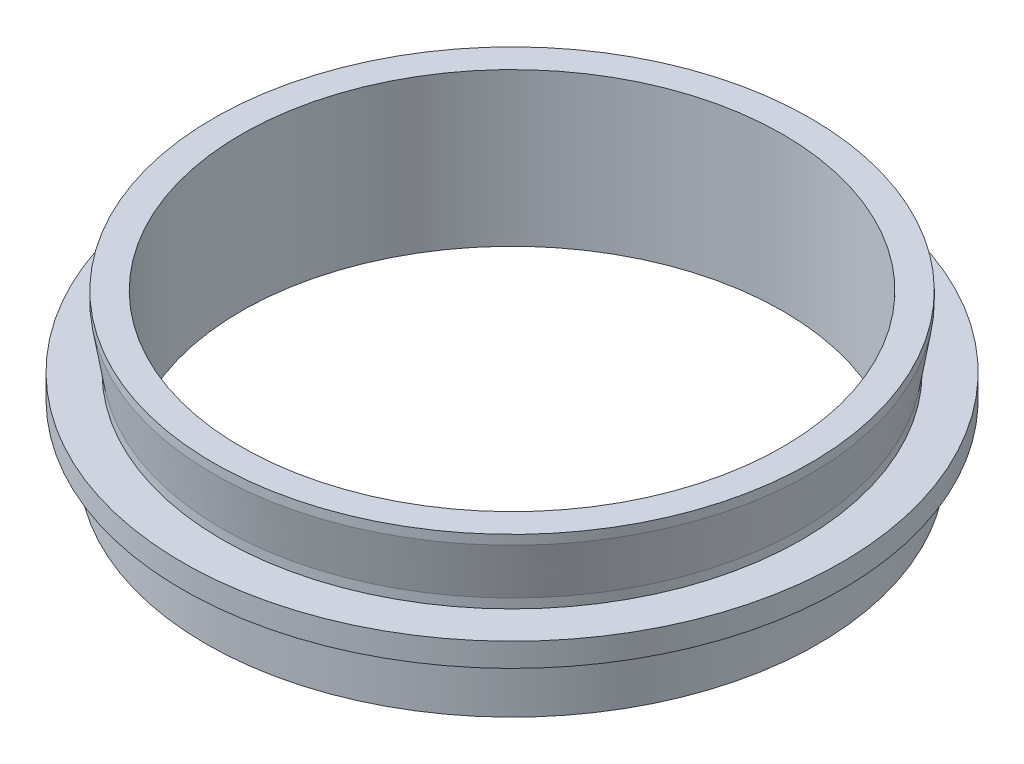
ISO-10303-21;
HEADER;
FILE_DESCRIPTION(('STEP AP214'),'2;1');
FILE_NAME('part.step','',(''),(''),'','','');
FILE_SCHEMA(('AUTOMOTIVE_DESIGN { 1 0 10303 214 1 1 1 1 }'));
ENDSEC;
DATA;
#1=APPLICATION_CONTEXT('core data for automotive mechanical design processes');
#2=APPLICATION_PROTOCOL_DEFINITION('international standard','automotive_design',2000,#1);
#3=PRODUCT_CONTEXT('',#1,'mechanical');
#4=PRODUCT('Part','Part','',(#3));
#5=PRODUCT_RELATED_PRODUCT_CATEGORY('part','',(#4));
#6=PRODUCT_DEFINITION_FORMATION('','',#4);
#7=PRODUCT_DEFINITION_CONTEXT('part definition',#1,'design');
#8=PRODUCT_DEFINITION('design','',#6,#7);
#9=PRODUCT_DEFINITION_SHAPE('','',#8);
#10=(LENGTH_UNIT() NAMED_UNIT(*) SI_UNIT(.MILLI.,.METRE.));
#11=(NAMED_UNIT(*) PLANE_ANGLE_UNIT() SI_UNIT($,.RADIAN.));
#12=(NAMED_UNIT(*) SI_UNIT($,.STERADIAN.) SOLID_ANGLE_UNIT());
#13=UNCERTAINTY_MEASURE_WITH_UNIT(LENGTH_MEASURE(1.E-05),#10,'distance_accuracy_value','');
#14=(GEOMETRIC_REPRESENTATION_CONTEXT(3) GLOBAL_UNCERTAINTY_ASSIGNED_CONTEXT((#13)) GLOBAL_UNIT_ASSIGNED_CONTEXT((#10,
#11,#12)) REPRESENTATION_CONTEXT('',''));
#15=CARTESIAN_POINT('',(0.,0.,0.));
#16=DIRECTION('',(0.,0.,1.));
#17=DIRECTION('',(1.,0.,0.));
#18=AXIS2_PLACEMENT_3D('',#15,#16,#17);
#19=CARTESIAN_POINT('',(-26.,0.,0.));
#20=DIRECTION('',(0.,1.,0.));
#21=DIRECTION('',(0.,0.,1.));
#22=AXIS2_PLACEMENT_3D('',#19,#20,#21);
#23=PLANE('',#22);
#24=CARTESIAN_POINT('',(0.,0.,0.));
#25=DIRECTION('',(0.,-1.,0.));
#26=DIRECTION('',(0.,0.,-1.));
#27=AXIS2_PLACEMENT_3D('',#24,#25,#26);
#28=CIRCLE('',#27,23.);
#29=CARTESIAN_POINT('',(0.,0.,-23.));
#30=VERTEX_POINT('',#29);
#31=EDGE_CURVE('E10',#30,#30,#28,.T.);
#32=ORIENTED_EDGE('',*,*,#31,.F.);
#33=EDGE_LOOP('',(#32));
#34=FACE_BOUND('',#33,.T.);
#35=CARTESIAN_POINT('',(0.,0.,0.));
#36=DIRECTION('',(0.,-1.,0.));
#37=DIRECTION('',(0.,0.,-1.));
#38=AXIS2_PLACEMENT_3D('',#35,#36,#37);
#39=CIRCLE('',#38,26.);
#40=CARTESIAN_POINT('',(0.,0.,-26.));
#41=VERTEX_POINT('',#40);
#42=EDGE_CURVE('E81',#41,#41,#39,.T.);
#43=ORIENTED_EDGE('',*,*,#42,.T.);
#44=EDGE_LOOP('',(#43));
#45=FACE_BOUND('',#44,.T.);
#46=ADVANCED_FACE('F41',(#34,#45),#23,.F.);
#47=CARTESIAN_POINT('',(0.,0.,0.));
#48=DIRECTION('',(0.,-1.,0.));
#49=DIRECTION('',(0.,0.,-1.));
#50=AXIS2_PLACEMENT_3D('',#47,#48,#49);
#51=CYLINDRICAL_SURFACE('',#50,23.);
#52=CARTESIAN_POINT('',(0.,13.,0.));
#53=DIRECTION('',(0.,-1.,0.));
#54=DIRECTION('',(0.,0.,-1.));
#55=AXIS2_PLACEMENT_3D('',#52,#53,#54);
#56=CIRCLE('',#55,23.);
#57=CARTESIAN_POINT('',(0.,13.,-23.));
#58=VERTEX_POINT('',#57);
#59=EDGE_CURVE('E47',#58,#58,#56,.T.);
#60=ORIENTED_EDGE('',*,*,#59,.F.);
#61=EDGE_LOOP('',(#60));
#62=FACE_BOUND('',#61,.T.);
#63=ORIENTED_EDGE('',*,*,#31,.T.);
#64=EDGE_LOOP('',(#63));
#65=FACE_BOUND('',#64,.T.);
#66=ADVANCED_FACE('F142',(#62,#65),#51,.F.);
#67=CARTESIAN_POINT('',(-23.,13.,0.));
#68=DIRECTION('',(0.,-1.,0.));
#69=DIRECTION('',(0.,0.,-1.));
#70=AXIS2_PLACEMENT_3D('',#67,#68,#69);
#71=PLANE('',#70);
#72=CARTESIAN_POINT('',(0.,13.,0.));
#73=DIRECTION('',(0.,-1.,0.));
#74=DIRECTION('',(0.,0.,-1.));
#75=AXIS2_PLACEMENT_3D('',#72,#73,#74);
#76=CIRCLE('',#75,25.365);
#77=CARTESIAN_POINT('',(0.,13.,-25.365));
#78=VERTEX_POINT('',#77);
#79=EDGE_CURVE('E51',#78,#78,#76,.T.);
#80=ORIENTED_EDGE('',*,*,#79,.F.);
#81=EDGE_LOOP('',(#80));
#82=FACE_BOUND('',#81,.T.);
#83=ORIENTED_EDGE('',*,*,#59,.T.);
#84=EDGE_LOOP('',(#83));
#85=FACE_BOUND('',#84,.T.);
#86=ADVANCED_FACE('F137',(#82,#85),#71,.F.);
#87=CARTESIAN_POINT('',(0.,0.,0.));
#88=DIRECTION('',(0.,-1.,0.));
#89=DIRECTION('',(0.,0.,-1.));
#90=AXIS2_PLACEMENT_3D('',#87,#88,#89);
#91=CYLINDRICAL_SURFACE('',#90,25.365);
#92=CARTESIAN_POINT('',(0.,12.2,0.));
#93=DIRECTION('',(0.,-1.,0.));
#94=DIRECTION('',(0.,0.,-1.));
#95=AXIS2_PLACEMENT_3D('',#92,#93,#94);
#96=CIRCLE('',#95,25.365);
#97=CARTESIAN_POINT('',(0.,12.2,-25.365));
#98=VERTEX_POINT('',#97);
#99=EDGE_CURVE('E55',#98,#98,#96,.T.);
#100=ORIENTED_EDGE('',*,*,#99,.F.);
#101=EDGE_LOOP('',(#100));
#102=FACE_BOUND('',#101,.T.);
#103=ORIENTED_EDGE('',*,*,#79,.T.);
#104=EDGE_LOOP('',(#103));
#105=FACE_BOUND('',#104,.T.);
#106=ADVANCED_FACE('F131',(#102,#105),#91,.T.);
#107=CARTESIAN_POINT('',(0.,12.2,0.));
#108=DIRECTION('',(0.,1.,0.));
#109=DIRECTION('',(0.,0.,1.));
#110=AXIS2_PLACEMENT_3D('',#107,#108,#109);
#111=CONICAL_SURFACE('',#110,25.365,0.164411486247026);
#112=CARTESIAN_POINT('',(0.,7.80000000000001,0.));
#113=DIRECTION('',(0.,-1.,0.));
#114=DIRECTION('',(0.,0.,-1.));
#115=AXIS2_PLACEMENT_3D('',#112,#113,#114);
#116=CIRCLE('',#115,24.635);
#117=CARTESIAN_POINT('',(0.,7.80000000000001,-24.635));
#118=VERTEX_POINT('',#117);
#119=EDGE_CURVE('E60',#118,#118,#116,.T.);
#120=ORIENTED_EDGE('',*,*,#119,.F.);
#121=EDGE_LOOP('',(#120));
#122=FACE_BOUND('',#121,.T.);
#123=ORIENTED_EDGE('',*,*,#99,.T.);
#124=EDGE_LOOP('',(#123));
#125=FACE_BOUND('',#124,.T.);
#126=ADVANCED_FACE('F125',(#122,#125),#111,.T.);
#127=CARTESIAN_POINT('',(0.,0.,0.));
#128=DIRECTION('',(0.,-1.,0.));
#129=DIRECTION('',(0.,0.,-1.));
#130=AXIS2_PLACEMENT_3D('',#127,#128,#129);
#131=CYLINDRICAL_SURFACE('',#130,24.635);
#132=CARTESIAN_POINT('',(0.,7.,0.));
#133=DIRECTION('',(0.,-1.,0.));
#134=DIRECTION('',(0.,0.,-1.));
#135=AXIS2_PLACEMENT_3D('',#132,#133,#134);
#136=CIRCLE('',#135,24.635);
#137=CARTESIAN_POINT('',(0.,7.,-24.635));
#138=VERTEX_POINT('',#137);
#139=EDGE_CURVE('E63',#138,#138,#136,.T.);
#140=ORIENTED_EDGE('',*,*,#139,.F.);
#141=EDGE_LOOP('',(#140));
#142=FACE_BOUND('',#141,.T.);
#143=ORIENTED_EDGE('',*,*,#119,.T.);
#144=EDGE_LOOP('',(#143));
#145=FACE_BOUND('',#144,.T.);
#146=ADVANCED_FACE('F119',(#142,#145),#131,.T.);
#147=CARTESIAN_POINT('',(-24.635,7.,0.));
#148=DIRECTION('',(0.,-1.,0.));
#149=DIRECTION('',(0.,0.,-1.));
#150=AXIS2_PLACEMENT_3D('',#147,#148,#149);
#151=PLANE('',#150);
#152=CARTESIAN_POINT('',(0.,7.,0.));
#153=DIRECTION('',(0.,-1.,0.));
#154=DIRECTION('',(0.,0.,-1.));
#155=AXIS2_PLACEMENT_3D('',#152,#153,#154);
#156=CIRCLE('',#155,28.);
#157=CARTESIAN_POINT('',(0.,7.,-28.));
#158=VERTEX_POINT('',#157);
#159=EDGE_CURVE('E66',#158,#158,#156,.T.);
#160=ORIENTED_EDGE('',*,*,#159,.F.);
#161=EDGE_LOOP('',(#160));
#162=FACE_BOUND('',#161,.T.);
#163=ORIENTED_EDGE('',*,*,#139,.T.);
#164=EDGE_LOOP('',(#163));
#165=FACE_BOUND('',#164,.T.);
#166=ADVANCED_FACE('F113',(#162,#165),#151,.F.);
#167=CARTESIAN_POINT('',(0.,0.,0.));
#168=DIRECTION('',(0.,-1.,0.));
#169=DIRECTION('',(0.,0.,-1.));
#170=AXIS2_PLACEMENT_3D('',#167,#168,#169);
#171=CYLINDRICAL_SURFACE('',#170,28.);
#172=CARTESIAN_POINT('',(0.,5.,0.));
#173=DIRECTION('',(0.,-1.,0.));
#174=DIRECTION('',(0.,0.,-1.));
#175=AXIS2_PLACEMENT_3D('',#172,#173,#174);
#176=CIRCLE('',#175,28.);
#177=CARTESIAN_POINT('',(0.,5.,-28.));
#178=VERTEX_POINT('',#177);
#179=EDGE_CURVE('E69',#178,#178,#176,.T.);
#180=ORIENTED_EDGE('',*,*,#179,.F.);
#181=EDGE_LOOP('',(#180));
#182=FACE_BOUND('',#181,.T.);
#183=ORIENTED_EDGE('',*,*,#159,.T.);
#184=EDGE_LOOP('',(#183));
#185=FACE_BOUND('',#184,.T.);
#186=ADVANCED_FACE('F107',(#182,#185),#171,.T.);
#187=CARTESIAN_POINT('',(-28.,5.,0.));
#188=DIRECTION('',(0.,1.,0.));
#189=DIRECTION('',(0.,0.,1.));
#190=AXIS2_PLACEMENT_3D('',#187,#188,#189);
#191=PLANE('',#190);
#192=CARTESIAN_POINT('',(0.,5.,0.));
#193=DIRECTION('',(0.,-1.,0.));
#194=DIRECTION('',(0.,0.,-1.));
#195=AXIS2_PLACEMENT_3D('',#192,#193,#194);
#196=CIRCLE('',#195,25.6);
#197=CARTESIAN_POINT('',(0.,5.,-25.6));
#198=VERTEX_POINT('',#197);
#199=EDGE_CURVE('E72',#198,#198,#196,.T.);
#200=ORIENTED_EDGE('',*,*,#199,.F.);
#201=EDGE_LOOP('',(#200));
#202=FACE_BOUND('',#201,.T.);
#203=ORIENTED_EDGE('',*,*,#179,.T.);
#204=EDGE_LOOP('',(#203));
#205=FACE_BOUND('',#204,.T.);
#206=ADVANCED_FACE('F101',(#202,#205),#191,.F.);
#207=CARTESIAN_POINT('',(0.,0.,0.));
#208=DIRECTION('',(0.,-1.,0.));
#209=DIRECTION('',(0.,0.,-1.));
#210=AXIS2_PLACEMENT_3D('',#207,#208,#209);
#211=CYLINDRICAL_SURFACE('',#210,25.6);
#212=CARTESIAN_POINT('',(0.,4.,0.));
#213=DIRECTION('',(0.,-1.,0.));
#214=DIRECTION('',(0.,0.,-1.));
#215=AXIS2_PLACEMENT_3D('',#212,#213,#214);
#216=CIRCLE('',#215,25.6);
#217=CARTESIAN_POINT('',(0.,4.,-25.6));
#218=VERTEX_POINT('',#217);
#219=EDGE_CURVE('E75',#218,#218,#216,.T.);
#220=ORIENTED_EDGE('',*,*,#219,.F.);
#221=EDGE_LOOP('',(#220));
#222=FACE_BOUND('',#221,.T.);
#223=ORIENTED_EDGE('',*,*,#199,.T.);
#224=EDGE_LOOP('',(#223));
#225=FACE_BOUND('',#224,.T.);
#226=ADVANCED_FACE('F95',(#222,#225),#211,.T.);
#227=CARTESIAN_POINT('',(-25.6,4.,0.));
#228=DIRECTION('',(0.,-1.,0.));
#229=DIRECTION('',(0.,0.,-1.));
#230=AXIS2_PLACEMENT_3D('',#227,#228,#229);
#231=PLANE('',#230);
#232=CARTESIAN_POINT('',(0.,4.,0.));
#233=DIRECTION('',(0.,-1.,0.));
#234=DIRECTION('',(0.,0.,-1.));
#235=AXIS2_PLACEMENT_3D('',#232,#233,#234);
#236=CIRCLE('',#235,26.);
#237=CARTESIAN_POINT('',(0.,4.,-26.));
#238=VERTEX_POINT('',#237);
#239=EDGE_CURVE('E78',#238,#238,#236,.T.);
#240=ORIENTED_EDGE('',*,*,#239,.F.);
#241=EDGE_LOOP('',(#240));
#242=FACE_BOUND('',#241,.T.);
#243=ORIENTED_EDGE('',*,*,#219,.T.);
#244=EDGE_LOOP('',(#243));
#245=FACE_BOUND('',#244,.T.);
#246=ADVANCED_FACE('F89',(#242,#245),#231,.F.);
#247=CARTESIAN_POINT('',(0.,0.,0.));
#248=DIRECTION('',(0.,-1.,0.));
#249=DIRECTION('',(0.,0.,-1.));
#250=AXIS2_PLACEMENT_3D('',#247,#248,#249);
#251=CYLINDRICAL_SURFACE('',#250,26.);
#252=ORIENTED_EDGE('',*,*,#42,.F.);
#253=EDGE_LOOP('',(#252));
#254=FACE_BOUND('',#253,.T.);
#255=ORIENTED_EDGE('',*,*,#239,.T.);
#256=EDGE_LOOP('',(#255));
#257=FACE_BOUND('',#256,.T.);
#258=ADVANCED_FACE('F86',(#254,#257),#251,.T.);
#259=CLOSED_SHELL('',(#46,#66,#86,#106,#126,#146,#166,#186,#206,#226,#246,#258));
#260=MANIFOLD_SOLID_BREP('B2',#259);
#261=ADVANCED_BREP_SHAPE_REPRESENTATION('',(#18,#260),#14);
#262=SHAPE_DEFINITION_REPRESENTATION(#9,#261);
ENDSEC;
END-ISO-10303-21;
